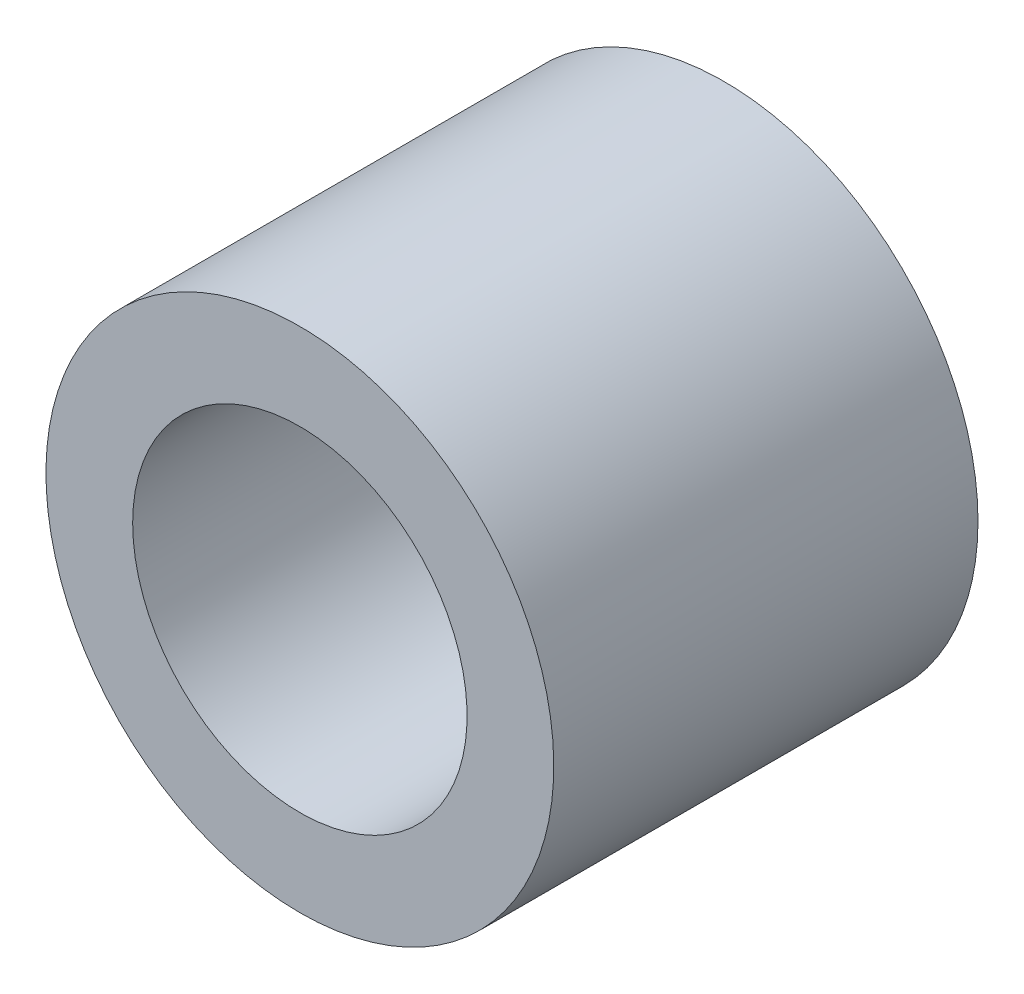
ISO-10303-21;
HEADER;
FILE_DESCRIPTION(('STEP AP214'),'2;1');
FILE_NAME('part.step','',(''),(''),'','','');
FILE_SCHEMA(('AUTOMOTIVE_DESIGN { 1 0 10303 214 1 1 1 1 }'));
ENDSEC;
DATA;
#1=APPLICATION_CONTEXT('core data for automotive mechanical design processes');
#2=APPLICATION_PROTOCOL_DEFINITION('international standard','automotive_design',2000,#1);
#3=PRODUCT_CONTEXT('',#1,'mechanical');
#4=PRODUCT('Part','Part','',(#3));
#5=PRODUCT_RELATED_PRODUCT_CATEGORY('part','',(#4));
#6=PRODUCT_DEFINITION_FORMATION('','',#4);
#7=PRODUCT_DEFINITION_CONTEXT('part definition',#1,'design');
#8=PRODUCT_DEFINITION('design','',#6,#7);
#9=PRODUCT_DEFINITION_SHAPE('','',#8);
#10=(LENGTH_UNIT() NAMED_UNIT(*) SI_UNIT(.MILLI.,.METRE.));
#11=(NAMED_UNIT(*) PLANE_ANGLE_UNIT() SI_UNIT($,.RADIAN.));
#12=(NAMED_UNIT(*) SI_UNIT($,.STERADIAN.) SOLID_ANGLE_UNIT());
#13=UNCERTAINTY_MEASURE_WITH_UNIT(LENGTH_MEASURE(1.E-05),#10,'distance_accuracy_value','');
#14=(GEOMETRIC_REPRESENTATION_CONTEXT(3) GLOBAL_UNCERTAINTY_ASSIGNED_CONTEXT((#13)) GLOBAL_UNIT_ASSIGNED_CONTEXT((#10,
#11,#12)) REPRESENTATION_CONTEXT('',''));
#15=CARTESIAN_POINT('',(0.,0.,0.));
#16=DIRECTION('',(0.,0.,1.));
#17=DIRECTION('',(1.,0.,0.));
#18=AXIS2_PLACEMENT_3D('',#15,#16,#17);
#19=CARTESIAN_POINT('',(59.4755457763826,35.5700000008553,18.4465512114576));
#20=DIRECTION('',(0.,0.,-1.));
#21=DIRECTION('',(-1.,0.,0.));
#22=AXIS2_PLACEMENT_3D('',#19,#20,#21);
#23=CYLINDRICAL_SURFACE('',#22,4.09999999999999);
#24=CARTESIAN_POINT('',(59.4755457763826,35.5700000008553,0.));
#25=DIRECTION('',(0.,0.,1.));
#26=DIRECTION('',(1.,0.,0.));
#27=AXIS2_PLACEMENT_3D('',#24,#25,#26);
#28=CIRCLE('',#27,4.09999999999999);
#29=CARTESIAN_POINT('',(63.5755457763826,35.5700000008553,0.));
#30=VERTEX_POINT('',#29);
#31=EDGE_CURVE('E38',#30,#30,#28,.T.);
#32=ORIENTED_EDGE('',*,*,#31,.T.);
#33=EDGE_LOOP('',(#32));
#34=FACE_BOUND('',#33,.T.);
#35=CARTESIAN_POINT('',(59.4755457763826,35.5700000008553,6.84999999999824));
#36=DIRECTION('',(0.,0.,1.));
#37=DIRECTION('',(0.,-1.,0.));
#38=AXIS2_PLACEMENT_3D('',#35,#36,#37);
#39=CIRCLE('',#38,4.09999999999999);
#40=CARTESIAN_POINT('',(59.4755457763826,31.4700000008553,6.84999999999824));
#41=VERTEX_POINT('',#40);
#42=EDGE_CURVE('E10',#41,#41,#39,.T.);
#43=ORIENTED_EDGE('',*,*,#42,.F.);
#44=EDGE_LOOP('',(#43));
#45=FACE_BOUND('',#44,.T.);
#46=ADVANCED_FACE('F31',(#34,#45),#23,.T.);
#47=CARTESIAN_POINT('',(59.4755457763826,35.5700000008553,0.));
#48=DIRECTION('',(0.,0.,1.));
#49=DIRECTION('',(1.,0.,0.));
#50=AXIS2_PLACEMENT_3D('',#47,#48,#49);
#51=PLANE('',#50);
#52=CARTESIAN_POINT('',(59.4755457763826,35.5700000008553,0.));
#53=DIRECTION('',(0.,0.,-1.));
#54=DIRECTION('',(-1.,0.,0.));
#55=AXIS2_PLACEMENT_3D('',#52,#53,#54);
#56=CIRCLE('',#55,2.69999999999999);
#57=CARTESIAN_POINT('',(56.7755457763826,35.5700000008553,0.));
#58=VERTEX_POINT('',#57);
#59=EDGE_CURVE('E46',#58,#58,#56,.T.);
#60=ORIENTED_EDGE('',*,*,#59,.F.);
#61=EDGE_LOOP('',(#60));
#62=FACE_BOUND('',#61,.T.);
#63=ORIENTED_EDGE('',*,*,#31,.F.);
#64=EDGE_LOOP('',(#63));
#65=FACE_BOUND('',#64,.T.);
#66=ADVANCED_FACE('F54',(#62,#65),#51,.F.);
#67=CARTESIAN_POINT('',(60.8768027881007,33.739623322535,6.84999999999824));
#68=DIRECTION('',(0.,0.,1.));
#69=DIRECTION('',(-0.991298678102129,0.131631800082545,0.));
#70=AXIS2_PLACEMENT_3D('',#67,#68,#69);
#71=PLANE('',#70);
#72=CARTESIAN_POINT('',(59.4755457763826,35.5700000008553,6.84999999999825));
#73=DIRECTION('',(0.,0.,-1.));
#74=DIRECTION('',(-1.,0.,0.));
#75=AXIS2_PLACEMENT_3D('',#72,#73,#74);
#76=CIRCLE('',#75,2.69999999999999);
#77=CARTESIAN_POINT('',(56.7755457763826,35.5700000008553,6.84999999999825));
#78=VERTEX_POINT('',#77);
#79=EDGE_CURVE('E42',#78,#78,#76,.T.);
#80=ORIENTED_EDGE('',*,*,#79,.T.);
#81=EDGE_LOOP('',(#80));
#82=FACE_BOUND('',#81,.T.);
#83=ORIENTED_EDGE('',*,*,#42,.T.);
#84=EDGE_LOOP('',(#83));
#85=FACE_BOUND('',#84,.T.);
#86=ADVANCED_FACE('F33',(#82,#85),#71,.T.);
#87=CARTESIAN_POINT('',(59.4755457763826,35.5700000008553,0.));
#88=DIRECTION('',(0.,0.,-1.));
#89=DIRECTION('',(-1.,0.,0.));
#90=AXIS2_PLACEMENT_3D('',#87,#88,#89);
#91=CYLINDRICAL_SURFACE('',#90,2.69999999999999);
#92=ORIENTED_EDGE('',*,*,#79,.F.);
#93=EDGE_LOOP('',(#92));
#94=FACE_BOUND('',#93,.T.);
#95=ORIENTED_EDGE('',*,*,#59,.T.);
#96=EDGE_LOOP('',(#95));
#97=FACE_BOUND('',#96,.T.);
#98=ADVANCED_FACE('F52',(#94,#97),#91,.F.);
#99=CLOSED_SHELL('',(#46,#66,#86,#98));
#100=MANIFOLD_SOLID_BREP('B2',#99);
#101=ADVANCED_BREP_SHAPE_REPRESENTATION('',(#18,#100),#14);
#102=SHAPE_DEFINITION_REPRESENTATION(#9,#101);
ENDSEC;
END-ISO-10303-21;
